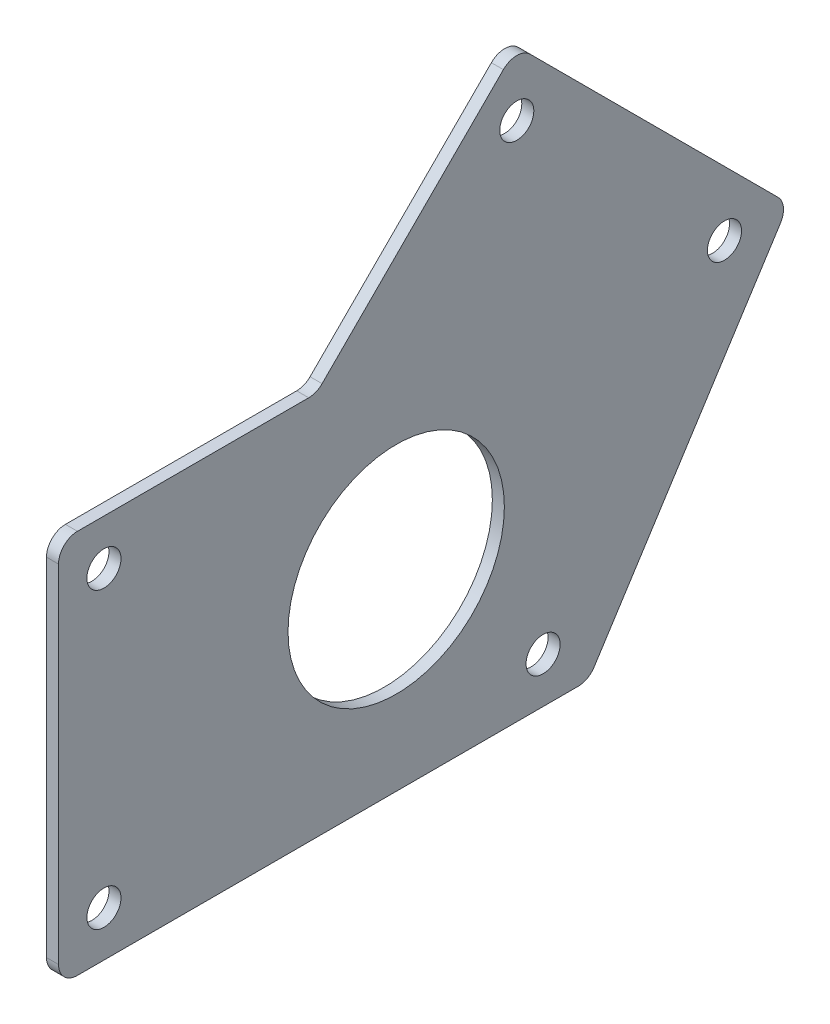
ISO-10303-21;
HEADER;
FILE_DESCRIPTION(('STEP AP214'),'2;1');
FILE_NAME('part.step','',(''),(''),'','','');
FILE_SCHEMA(('AUTOMOTIVE_DESIGN { 1 0 10303 214 1 1 1 1 }'));
ENDSEC;
DATA;
#1=APPLICATION_CONTEXT('core data for automotive mechanical design processes');
#2=APPLICATION_PROTOCOL_DEFINITION('international standard','automotive_design',2000,#1);
#3=PRODUCT_CONTEXT('',#1,'mechanical');
#4=PRODUCT('Part','Part','',(#3));
#5=PRODUCT_RELATED_PRODUCT_CATEGORY('part','',(#4));
#6=PRODUCT_DEFINITION_FORMATION('','',#4);
#7=PRODUCT_DEFINITION_CONTEXT('part definition',#1,'design');
#8=PRODUCT_DEFINITION('design','',#6,#7);
#9=PRODUCT_DEFINITION_SHAPE('','',#8);
#10=(LENGTH_UNIT() NAMED_UNIT(*) SI_UNIT(.MILLI.,.METRE.));
#11=(NAMED_UNIT(*) PLANE_ANGLE_UNIT() SI_UNIT($,.RADIAN.));
#12=(NAMED_UNIT(*) SI_UNIT($,.STERADIAN.) SOLID_ANGLE_UNIT());
#13=UNCERTAINTY_MEASURE_WITH_UNIT(LENGTH_MEASURE(1.E-05),#10,'distance_accuracy_value','');
#14=(GEOMETRIC_REPRESENTATION_CONTEXT(3) GLOBAL_UNCERTAINTY_ASSIGNED_CONTEXT((#13)) GLOBAL_UNIT_ASSIGNED_CONTEXT((#10,
#11,#12)) REPRESENTATION_CONTEXT('',''));
#15=CARTESIAN_POINT('',(0.,0.,0.));
#16=DIRECTION('',(0.,0.,1.));
#17=DIRECTION('',(1.,0.,0.));
#18=AXIS2_PLACEMENT_3D('',#15,#16,#17);
#19=CARTESIAN_POINT('',(103.1875,27.9,-117.643441609791));
#20=DIRECTION('',(-1.,0.,0.));
#21=DIRECTION('',(0.,0.,1.));
#22=AXIS2_PLACEMENT_3D('',#19,#20,#21);
#23=CYLINDRICAL_SURFACE('',#22,2.5);
#24=CARTESIAN_POINT('',(101.6,27.9,-117.643441609791));
#25=DIRECTION('',(1.,0.,0.));
#26=DIRECTION('',(0.,0.,-1.));
#27=AXIS2_PLACEMENT_3D('',#24,#25,#26);
#28=CIRCLE('',#27,2.5);
#29=CARTESIAN_POINT('',(101.6,25.4,-117.643441609791));
#30=VERTEX_POINT('',#29);
#31=CARTESIAN_POINT('',(101.6,26.1322330470337,-119.411208562757));
#32=VERTEX_POINT('',#31);
#33=EDGE_CURVE('E178',#30,#32,#28,.T.);
#34=ORIENTED_EDGE('',*,*,#33,.F.);
#35=DIRECTION('',(-1.,0.,0.));
#36=VECTOR('',#35,1.);
#37=CARTESIAN_POINT('',(103.1875,25.4,-117.643441609791));
#38=LINE('',#37,#36);
#39=CARTESIAN_POINT('',(103.1875,25.4,-117.643441609791));
#40=VERTEX_POINT('',#39);
#41=EDGE_CURVE('E11',#40,#30,#38,.T.);
#42=ORIENTED_EDGE('',*,*,#41,.F.);
#43=CARTESIAN_POINT('',(103.1875,27.9,-117.643441609791));
#44=DIRECTION('',(1.,0.,0.));
#45=DIRECTION('',(0.,0.,-1.));
#46=AXIS2_PLACEMENT_3D('',#43,#44,#45);
#47=CIRCLE('',#46,2.5);
#48=CARTESIAN_POINT('',(103.1875,26.1322330470337,-119.411208562757));
#49=VERTEX_POINT('',#48);
#50=EDGE_CURVE('E227',#40,#49,#47,.T.);
#51=ORIENTED_EDGE('',*,*,#50,.T.);
#52=DIRECTION('',(-1.,0.,0.));
#53=VECTOR('',#52,1.);
#54=CARTESIAN_POINT('',(103.1875,26.1322330470337,-119.411208562757));
#55=LINE('',#54,#53);
#56=EDGE_CURVE('E57',#49,#32,#55,.T.);
#57=ORIENTED_EDGE('',*,*,#56,.T.);
#58=EDGE_LOOP('',(#34,#42,#51,#57));
#59=FACE_BOUND('',#58,.T.);
#60=ADVANCED_FACE('F41',(#59),#23,.F.);
#61=CARTESIAN_POINT('',(103.1875,25.4,0.));
#62=DIRECTION('',(0.,-1.,0.));
#63=DIRECTION('',(0.,0.,-1.));
#64=AXIS2_PLACEMENT_3D('',#61,#62,#63);
#65=PLANE('',#64);
#66=DIRECTION('',(0.,0.,1.));
#67=VECTOR('',#66,1.);
#68=CARTESIAN_POINT('',(101.6,25.4,0.));
#69=LINE('',#68,#67);
#70=CARTESIAN_POINT('',(101.6,25.4,-87.1));
#71=VERTEX_POINT('',#70);
#72=EDGE_CURVE('E180',#30,#71,#69,.T.);
#73=ORIENTED_EDGE('',*,*,#72,.T.);
#74=DIRECTION('',(-1.,0.,0.));
#75=VECTOR('',#74,1.);
#76=CARTESIAN_POINT('',(103.1875,25.4,-87.1));
#77=LINE('',#76,#75);
#78=CARTESIAN_POINT('',(103.1875,25.4,-87.1));
#79=VERTEX_POINT('',#78);
#80=EDGE_CURVE('E49',#79,#71,#77,.T.);
#81=ORIENTED_EDGE('',*,*,#80,.F.);
#82=DIRECTION('',(0.,0.,1.));
#83=VECTOR('',#82,1.);
#84=CARTESIAN_POINT('',(103.1875,25.4,0.));
#85=LINE('',#84,#83);
#86=EDGE_CURVE('E268',#40,#79,#85,.T.);
#87=ORIENTED_EDGE('',*,*,#86,.F.);
#88=ORIENTED_EDGE('',*,*,#41,.T.);
#89=EDGE_LOOP('',(#73,#81,#87,#88));
#90=FACE_BOUND('',#89,.T.);
#91=ADVANCED_FACE('F298',(#90),#65,.F.);
#92=CARTESIAN_POINT('',(103.1875,22.9,-87.1));
#93=DIRECTION('',(-1.,0.,0.));
#94=DIRECTION('',(0.,0.,1.));
#95=AXIS2_PLACEMENT_3D('',#92,#93,#94);
#96=CYLINDRICAL_SURFACE('',#95,2.5);
#97=CARTESIAN_POINT('',(101.6,22.9,-87.1));
#98=DIRECTION('',(1.,0.,0.));
#99=DIRECTION('',(0.,0.,-1.));
#100=AXIS2_PLACEMENT_3D('',#97,#98,#99);
#101=CIRCLE('',#100,2.5);
#102=CARTESIAN_POINT('',(101.6,22.9,-84.6));
#103=VERTEX_POINT('',#102);
#104=EDGE_CURVE('E182',#71,#103,#101,.T.);
#105=ORIENTED_EDGE('',*,*,#104,.T.);
#106=DIRECTION('',(-1.,0.,0.));
#107=VECTOR('',#106,1.);
#108=CARTESIAN_POINT('',(103.1875,22.9,-84.6));
#109=LINE('',#108,#107);
#110=CARTESIAN_POINT('',(103.1875,22.9,-84.6));
#111=VERTEX_POINT('',#110);
#112=EDGE_CURVE('E241',#111,#103,#109,.T.);
#113=ORIENTED_EDGE('',*,*,#112,.F.);
#114=CARTESIAN_POINT('',(103.1875,22.9,-87.1));
#115=DIRECTION('',(1.,0.,0.));
#116=DIRECTION('',(0.,0.,-1.));
#117=AXIS2_PLACEMENT_3D('',#114,#115,#116);
#118=CIRCLE('',#117,2.5);
#119=EDGE_CURVE('E249',#79,#111,#118,.T.);
#120=ORIENTED_EDGE('',*,*,#119,.F.);
#121=ORIENTED_EDGE('',*,*,#80,.T.);
#122=EDGE_LOOP('',(#105,#113,#120,#121));
#123=FACE_BOUND('',#122,.T.);
#124=ADVANCED_FACE('F247',(#123),#96,.T.);
#125=CARTESIAN_POINT('',(103.1875,0.,-84.6));
#126=DIRECTION('',(0.,0.,1.));
#127=DIRECTION('',(1.,0.,0.));
#128=AXIS2_PLACEMENT_3D('',#125,#126,#127);
#129=PLANE('',#128);
#130=DIRECTION('',(0.,1.,0.));
#131=VECTOR('',#130,1.);
#132=CARTESIAN_POINT('',(101.6,0.,-84.6));
#133=LINE('',#132,#131);
#134=CARTESIAN_POINT('',(101.6,-22.9,-84.6));
#135=VERTEX_POINT('',#134);
#136=EDGE_CURVE('E185',#135,#103,#133,.T.);
#137=ORIENTED_EDGE('',*,*,#136,.F.);
#138=DIRECTION('',(-1.,0.,0.));
#139=VECTOR('',#138,1.);
#140=CARTESIAN_POINT('',(103.1875,-22.9,-84.6));
#141=LINE('',#140,#139);
#142=CARTESIAN_POINT('',(103.1875,-22.9,-84.6));
#143=VERTEX_POINT('',#142);
#144=EDGE_CURVE('E239',#143,#135,#141,.T.);
#145=ORIENTED_EDGE('',*,*,#144,.F.);
#146=DIRECTION('',(0.,1.,0.));
#147=VECTOR('',#146,1.);
#148=CARTESIAN_POINT('',(103.1875,0.,-84.6));
#149=LINE('',#148,#147);
#150=EDGE_CURVE('E261',#143,#111,#149,.T.);
#151=ORIENTED_EDGE('',*,*,#150,.T.);
#152=ORIENTED_EDGE('',*,*,#112,.T.);
#153=EDGE_LOOP('',(#137,#145,#151,#152));
#154=FACE_BOUND('',#153,.T.);
#155=ADVANCED_FACE('F258',(#154),#129,.T.);
#156=CARTESIAN_POINT('',(103.1875,-22.9,-87.1));
#157=DIRECTION('',(-1.,0.,0.));
#158=DIRECTION('',(0.,0.,1.));
#159=AXIS2_PLACEMENT_3D('',#156,#157,#158);
#160=CYLINDRICAL_SURFACE('',#159,2.5);
#161=CARTESIAN_POINT('',(101.6,-22.9,-87.1));
#162=DIRECTION('',(1.,0.,0.));
#163=DIRECTION('',(0.,0.,-1.));
#164=AXIS2_PLACEMENT_3D('',#161,#162,#163);
#165=CIRCLE('',#164,2.5);
#166=CARTESIAN_POINT('',(101.6,-25.4,-87.1));
#167=VERTEX_POINT('',#166);
#168=EDGE_CURVE('E188',#167,#135,#165,.F.);
#169=ORIENTED_EDGE('',*,*,#168,.F.);
#170=DIRECTION('',(-1.,0.,0.));
#171=VECTOR('',#170,1.);
#172=CARTESIAN_POINT('',(103.1875,-25.4,-87.1));
#173=LINE('',#172,#171);
#174=CARTESIAN_POINT('',(103.1875,-25.4,-87.1));
#175=VERTEX_POINT('',#174);
#176=EDGE_CURVE('E237',#175,#167,#173,.T.);
#177=ORIENTED_EDGE('',*,*,#176,.F.);
#178=CARTESIAN_POINT('',(103.1875,-22.9,-87.1));
#179=DIRECTION('',(1.,0.,0.));
#180=DIRECTION('',(0.,0.,-1.));
#181=AXIS2_PLACEMENT_3D('',#178,#179,#180);
#182=CIRCLE('',#181,2.5);
#183=EDGE_CURVE('E264',#175,#143,#182,.F.);
#184=ORIENTED_EDGE('',*,*,#183,.T.);
#185=ORIENTED_EDGE('',*,*,#144,.T.);
#186=EDGE_LOOP('',(#169,#177,#184,#185));
#187=FACE_BOUND('',#186,.T.);
#188=ADVANCED_FACE('F309',(#187),#160,.T.);
#189=CARTESIAN_POINT('',(103.1875,-25.4,0.));
#190=DIRECTION('',(0.,-1.,0.));
#191=DIRECTION('',(0.,0.,-1.));
#192=AXIS2_PLACEMENT_3D('',#189,#190,#191);
#193=PLANE('',#192);
#194=DIRECTION('',(0.,0.,1.));
#195=VECTOR('',#194,1.);
#196=CARTESIAN_POINT('',(101.6,-25.4,0.));
#197=LINE('',#196,#195);
#198=CARTESIAN_POINT('',(101.6,-25.4,-153.231778176145));
#199=VERTEX_POINT('',#198);
#200=EDGE_CURVE('E191',#199,#167,#197,.T.);
#201=ORIENTED_EDGE('',*,*,#200,.F.);
#202=DIRECTION('',(-1.,0.,0.));
#203=VECTOR('',#202,1.);
#204=CARTESIAN_POINT('',(103.1875,-25.4,-153.231778176145));
#205=LINE('',#204,#203);
#206=CARTESIAN_POINT('',(103.1875,-25.4,-153.231778176145));
#207=VERTEX_POINT('',#206);
#208=EDGE_CURVE('E235',#207,#199,#205,.T.);
#209=ORIENTED_EDGE('',*,*,#208,.F.);
#210=DIRECTION('',(0.,0.,1.));
#211=VECTOR('',#210,1.);
#212=CARTESIAN_POINT('',(103.1875,-25.4,0.));
#213=LINE('',#212,#211);
#214=EDGE_CURVE('E266',#207,#175,#213,.T.);
#215=ORIENTED_EDGE('',*,*,#214,.T.);
#216=ORIENTED_EDGE('',*,*,#176,.T.);
#217=EDGE_LOOP('',(#201,#209,#215,#216));
#218=FACE_BOUND('',#217,.T.);
#219=ADVANCED_FACE('F312',(#218),#193,.T.);
#220=CARTESIAN_POINT('',(103.1875,-22.9,-153.231778176145));
#221=DIRECTION('',(-1.,0.,0.));
#222=DIRECTION('',(0.,0.,1.));
#223=AXIS2_PLACEMENT_3D('',#220,#221,#222);
#224=CYLINDRICAL_SURFACE('',#223,2.5);
#225=CARTESIAN_POINT('',(101.6,-22.9,-153.231778176145));
#226=DIRECTION('',(1.,0.,0.));
#227=DIRECTION('',(0.,0.,-1.));
#228=AXIS2_PLACEMENT_3D('',#225,#226,#227);
#229=CIRCLE('',#228,2.5);
#230=CARTESIAN_POINT('',(101.6,-24.2475598229923,-155.337504303507));
#231=VERTEX_POINT('',#230);
#232=EDGE_CURVE('E194',#199,#231,#229,.T.);
#233=ORIENTED_EDGE('',*,*,#232,.T.);
#234=DIRECTION('',(-1.,0.,0.));
#235=VECTOR('',#234,1.);
#236=CARTESIAN_POINT('',(103.1875,-24.2475598229923,-155.337504303507));
#237=LINE('',#236,#235);
#238=CARTESIAN_POINT('',(103.1875,-24.2475598229923,-155.337504303507));
#239=VERTEX_POINT('',#238);
#240=EDGE_CURVE('E233',#239,#231,#237,.T.);
#241=ORIENTED_EDGE('',*,*,#240,.F.);
#242=CARTESIAN_POINT('',(103.1875,-22.9,-153.231778176145));
#243=DIRECTION('',(1.,0.,0.));
#244=DIRECTION('',(0.,0.,-1.));
#245=AXIS2_PLACEMENT_3D('',#242,#243,#244);
#246=CIRCLE('',#245,2.5);
#247=EDGE_CURVE('E274',#207,#239,#246,.T.);
#248=ORIENTED_EDGE('',*,*,#247,.F.);
#249=ORIENTED_EDGE('',*,*,#208,.T.);
#250=EDGE_LOOP('',(#233,#241,#248,#249));
#251=FACE_BOUND('',#250,.T.);
#252=ADVANCED_FACE('F316',(#251),#224,.T.);
#253=CARTESIAN_POINT('',(103.1875,-77.5705625422909,-121.213438893427));
#254=DIRECTION('',(0.,-0.539023929196903,-0.842290450945));
#255=DIRECTION('',(0.,0.842290450945,-0.539023929196903));
#256=AXIS2_PLACEMENT_3D('',#253,#254,#255);
#257=PLANE('',#256);
#258=DIRECTION('',(0.,-0.842290450945,0.539023929196903));
#259=VECTOR('',#258,1.);
#260=CARTESIAN_POINT('',(101.6,-77.5705625422909,-121.213438893427));
#261=LINE('',#260,#259);
#262=CARTESIAN_POINT('',(101.6,14.2312008588714,-179.961994288043));
#263=VERTEX_POINT('',#262);
#264=EDGE_CURVE('E197',#263,#231,#261,.T.);
#265=ORIENTED_EDGE('',*,*,#264,.F.);
#266=DIRECTION('',(-1.,0.,0.));
#267=VECTOR('',#266,1.);
#268=CARTESIAN_POINT('',(103.1875,14.2312008588714,-179.961994288043));
#269=LINE('',#268,#267);
#270=CARTESIAN_POINT('',(103.1875,14.2312008588714,-179.961994288043));
#271=VERTEX_POINT('',#270);
#272=EDGE_CURVE('E231',#271,#263,#269,.T.);
#273=ORIENTED_EDGE('',*,*,#272,.F.);
#274=DIRECTION('',(0.,-0.842290450945,0.539023929196903));
#275=VECTOR('',#274,1.);
#276=CARTESIAN_POINT('',(103.1875,-77.5705625422909,-121.213438893427));
#277=LINE('',#276,#275);
#278=EDGE_CURVE('E276',#271,#239,#277,.T.);
#279=ORIENTED_EDGE('',*,*,#278,.T.);
#280=ORIENTED_EDGE('',*,*,#240,.T.);
#281=EDGE_LOOP('',(#265,#273,#279,#280));
#282=FACE_BOUND('',#281,.T.);
#283=ADVANCED_FACE('F320',(#282),#257,.T.);
#284=CARTESIAN_POINT('',(103.1875,15.5787606818636,-177.856268160681));
#285=DIRECTION('',(-1.,0.,0.));
#286=DIRECTION('',(0.,0.,1.));
#287=AXIS2_PLACEMENT_3D('',#284,#285,#286);
#288=CYLINDRICAL_SURFACE('',#287,2.49999999999999);
#289=CARTESIAN_POINT('',(101.6,15.5787606818636,-177.856268160681));
#290=DIRECTION('',(1.,0.,0.));
#291=DIRECTION('',(0.,0.,-1.));
#292=AXIS2_PLACEMENT_3D('',#289,#290,#291);
#293=CIRCLE('',#292,2.49999999999999);
#294=CARTESIAN_POINT('',(101.6,17.34652763483,-179.624035113647));
#295=VERTEX_POINT('',#294);
#296=EDGE_CURVE('E200',#295,#263,#293,.F.);
#297=ORIENTED_EDGE('',*,*,#296,.F.);
#298=DIRECTION('',(-1.,0.,0.));
#299=VECTOR('',#298,1.);
#300=CARTESIAN_POINT('',(103.1875,17.34652763483,-179.624035113647));
#301=LINE('',#300,#299);
#302=CARTESIAN_POINT('',(103.1875,17.34652763483,-179.624035113647));
#303=VERTEX_POINT('',#302);
#304=EDGE_CURVE('E140',#303,#295,#301,.T.);
#305=ORIENTED_EDGE('',*,*,#304,.F.);
#306=CARTESIAN_POINT('',(103.1875,15.5787606818636,-177.856268160681));
#307=DIRECTION('',(1.,0.,0.));
#308=DIRECTION('',(0.,0.,-1.));
#309=AXIS2_PLACEMENT_3D('',#306,#307,#308);
#310=CIRCLE('',#309,2.49999999999999);
#311=EDGE_CURVE('E152',#303,#271,#310,.F.);
#312=ORIENTED_EDGE('',*,*,#311,.T.);
#313=ORIENTED_EDGE('',*,*,#272,.T.);
#314=EDGE_LOOP('',(#297,#305,#312,#313));
#315=FACE_BOUND('',#314,.T.);
#316=ADVANCED_FACE('F280',(#315),#288,.T.);
#317=CARTESIAN_POINT('',(103.1875,98.4852813742386,-98.4852813742386));
#318=DIRECTION('',(0.,0.707106781186548,-0.707106781186547));
#319=DIRECTION('',(0.,0.707106781186547,0.707106781186548));
#320=AXIS2_PLACEMENT_3D('',#317,#318,#319);
#321=PLANE('',#320);
#322=DIRECTION('',(0.,-0.707106781186547,-0.707106781186548));
#323=VECTOR('',#322,1.);
#324=CARTESIAN_POINT('',(101.6,98.4852813742386,-98.4852813742386));
#325=LINE('',#324,#323);
#326=CARTESIAN_POINT('',(101.6,50.0780266634105,-146.892536085067));
#327=VERTEX_POINT('',#326);
#328=EDGE_CURVE('E136',#327,#295,#325,.T.);
#329=ORIENTED_EDGE('',*,*,#328,.F.);
#330=DIRECTION('',(-1.,0.,0.));
#331=VECTOR('',#330,1.);
#332=CARTESIAN_POINT('',(103.1875,50.0780266634105,-146.892536085067));
#333=LINE('',#332,#331);
#334=CARTESIAN_POINT('',(103.1875,50.0780266634105,-146.892536085067));
#335=VERTEX_POINT('',#334);
#336=EDGE_CURVE('E131',#335,#327,#333,.T.);
#337=ORIENTED_EDGE('',*,*,#336,.F.);
#338=DIRECTION('',(0.,-0.707106781186547,-0.707106781186548));
#339=VECTOR('',#338,1.);
#340=CARTESIAN_POINT('',(103.1875,98.4852813742386,-98.4852813742386));
#341=LINE('',#340,#339);
#342=EDGE_CURVE('E134',#335,#303,#341,.T.);
#343=ORIENTED_EDGE('',*,*,#342,.T.);
#344=ORIENTED_EDGE('',*,*,#304,.T.);
#345=EDGE_LOOP('',(#329,#337,#343,#344));
#346=FACE_BOUND('',#345,.T.);
#347=ADVANCED_FACE('F133',(#346),#321,.T.);
#348=CARTESIAN_POINT('',(103.1875,48.3102597104441,-145.1247691321));
#349=DIRECTION('',(-1.,0.,0.));
#350=DIRECTION('',(0.,0.,1.));
#351=AXIS2_PLACEMENT_3D('',#348,#349,#350);
#352=CYLINDRICAL_SURFACE('',#351,2.5);
#353=CARTESIAN_POINT('',(101.6,48.3102597104441,-145.1247691321));
#354=DIRECTION('',(1.,0.,0.));
#355=DIRECTION('',(0.,0.,-1.));
#356=AXIS2_PLACEMENT_3D('',#353,#354,#355);
#357=CIRCLE('',#356,2.5);
#358=CARTESIAN_POINT('',(101.6,50.0780266634105,-143.357002179134));
#359=VERTEX_POINT('',#358);
#360=EDGE_CURVE('E204',#359,#327,#357,.F.);
#361=ORIENTED_EDGE('',*,*,#360,.F.);
#362=DIRECTION('',(-1.,0.,0.));
#363=VECTOR('',#362,1.);
#364=CARTESIAN_POINT('',(103.1875,50.0780266634105,-143.357002179134));
#365=LINE('',#364,#363);
#366=CARTESIAN_POINT('',(103.1875,50.0780266634105,-143.357002179134));
#367=VERTEX_POINT('',#366);
#368=EDGE_CURVE('E94',#367,#359,#365,.T.);
#369=ORIENTED_EDGE('',*,*,#368,.F.);
#370=CARTESIAN_POINT('',(103.1875,48.3102597104441,-145.1247691321));
#371=DIRECTION('',(1.,0.,0.));
#372=DIRECTION('',(0.,0.,-1.));
#373=AXIS2_PLACEMENT_3D('',#370,#371,#372);
#374=CIRCLE('',#373,2.5);
#375=EDGE_CURVE('E149',#367,#335,#374,.F.);
#376=ORIENTED_EDGE('',*,*,#375,.T.);
#377=ORIENTED_EDGE('',*,*,#336,.T.);
#378=EDGE_LOOP('',(#361,#369,#376,#377));
#379=FACE_BOUND('',#378,.T.);
#380=ADVANCED_FACE('F154',(#379),#352,.T.);
#381=CARTESIAN_POINT('',(103.1875,-19.4,-90.6));
#382=DIRECTION('',(-1.,0.,0.));
#383=DIRECTION('',(0.,0.,1.));
#384=AXIS2_PLACEMENT_3D('',#381,#382,#383);
#385=CYLINDRICAL_SURFACE('',#384,2.25);
#386=CARTESIAN_POINT('',(103.1875,-19.4,-90.6));
#387=DIRECTION('',(1.,0.,0.));
#388=DIRECTION('',(0.,0.,-1.));
#389=AXIS2_PLACEMENT_3D('',#386,#387,#388);
#390=CIRCLE('',#389,2.25);
#391=CARTESIAN_POINT('',(103.1875,-19.4,-92.85));
#392=VERTEX_POINT('',#391);
#393=EDGE_CURVE('E172',#392,#392,#390,.T.);
#394=ORIENTED_EDGE('',*,*,#393,.T.);
#395=EDGE_LOOP('',(#394));
#396=FACE_BOUND('',#395,.T.);
#397=CARTESIAN_POINT('',(101.6,-19.4,-90.6));
#398=DIRECTION('',(1.,0.,0.));
#399=DIRECTION('',(0.,0.,-1.));
#400=AXIS2_PLACEMENT_3D('',#397,#398,#399);
#401=CIRCLE('',#400,2.25);
#402=CARTESIAN_POINT('',(101.6,-19.4,-92.85));
#403=VERTEX_POINT('',#402);
#404=EDGE_CURVE('E221',#403,#403,#401,.T.);
#405=ORIENTED_EDGE('',*,*,#404,.F.);
#406=EDGE_LOOP('',(#405));
#407=FACE_BOUND('',#406,.T.);
#408=ADVANCED_FACE('F329',(#396,#407),#385,.F.);
#409=CARTESIAN_POINT('',(103.1875,-19.4,-148.6));
#410=DIRECTION('',(-1.,0.,0.));
#411=DIRECTION('',(0.,0.,1.));
#412=AXIS2_PLACEMENT_3D('',#409,#410,#411);
#413=CYLINDRICAL_SURFACE('',#412,2.25000000000001);
#414=CARTESIAN_POINT('',(103.1875,-19.4,-148.6));
#415=DIRECTION('',(1.,0.,0.));
#416=DIRECTION('',(0.,0.,-1.));
#417=AXIS2_PLACEMENT_3D('',#414,#415,#416);
#418=CIRCLE('',#417,2.25000000000001);
#419=CARTESIAN_POINT('',(103.1875,-19.4,-150.85));
#420=VERTEX_POINT('',#419);
#421=EDGE_CURVE('E169',#420,#420,#418,.T.);
#422=ORIENTED_EDGE('',*,*,#421,.T.);
#423=EDGE_LOOP('',(#422));
#424=FACE_BOUND('',#423,.T.);
#425=CARTESIAN_POINT('',(101.6,-19.4,-148.6));
#426=DIRECTION('',(1.,0.,0.));
#427=DIRECTION('',(0.,0.,-1.));
#428=AXIS2_PLACEMENT_3D('',#425,#426,#427);
#429=CIRCLE('',#428,2.25000000000001);
#430=CARTESIAN_POINT('',(101.6,-19.4,-150.85));
#431=VERTEX_POINT('',#430);
#432=EDGE_CURVE('E218',#431,#431,#429,.T.);
#433=ORIENTED_EDGE('',*,*,#432,.F.);
#434=EDGE_LOOP('',(#433));
#435=FACE_BOUND('',#434,.T.);
#436=ADVANCED_FACE('F333',(#424,#435),#413,.F.);
#437=CARTESIAN_POINT('',(103.1875,15.924769132098,-172.560512242141));
#438=DIRECTION('',(-1.,0.,0.));
#439=DIRECTION('',(0.,0.,1.));
#440=AXIS2_PLACEMENT_3D('',#437,#438,#439);
#441=CYLINDRICAL_SURFACE('',#440,2.25000000000001);
#442=CARTESIAN_POINT('',(103.1875,15.924769132098,-172.560512242141));
#443=DIRECTION('',(1.,0.,0.));
#444=DIRECTION('',(0.,0.,-1.));
#445=AXIS2_PLACEMENT_3D('',#442,#443,#444);
#446=CIRCLE('',#445,2.25000000000001);
#447=CARTESIAN_POINT('',(103.1875,15.924769132098,-174.810512242141));
#448=VERTEX_POINT('',#447);
#449=EDGE_CURVE('E166',#448,#448,#446,.T.);
#450=ORIENTED_EDGE('',*,*,#449,.T.);
#451=EDGE_LOOP('',(#450));
#452=FACE_BOUND('',#451,.T.);
#453=CARTESIAN_POINT('',(101.6,15.924769132098,-172.560512242141));
#454=DIRECTION('',(1.,0.,0.));
#455=DIRECTION('',(0.,0.,-1.));
#456=AXIS2_PLACEMENT_3D('',#453,#454,#455);
#457=CIRCLE('',#456,2.25000000000001);
#458=CARTESIAN_POINT('',(101.6,15.924769132098,-174.810512242141));
#459=VERTEX_POINT('',#458);
#460=EDGE_CURVE('E215',#459,#459,#457,.T.);
#461=ORIENTED_EDGE('',*,*,#460,.F.);
#462=EDGE_LOOP('',(#461));
#463=FACE_BOUND('',#462,.T.);
#464=ADVANCED_FACE('F339',(#452,#463),#441,.F.);
#465=CARTESIAN_POINT('',(103.1875,43.3605122421383,-145.1247691321));
#466=DIRECTION('',(-1.,0.,0.));
#467=DIRECTION('',(0.,0.,1.));
#468=AXIS2_PLACEMENT_3D('',#465,#466,#467);
#469=CYLINDRICAL_SURFACE('',#468,2.25000000000001);
#470=CARTESIAN_POINT('',(103.1875,43.3605122421383,-145.1247691321));
#471=DIRECTION('',(1.,0.,0.));
#472=DIRECTION('',(0.,0.,-1.));
#473=AXIS2_PLACEMENT_3D('',#470,#471,#472);
#474=CIRCLE('',#473,2.25000000000001);
#475=CARTESIAN_POINT('',(103.1875,43.3605122421383,-147.3747691321));
#476=VERTEX_POINT('',#475);
#477=EDGE_CURVE('E163',#476,#476,#474,.T.);
#478=ORIENTED_EDGE('',*,*,#477,.T.);
#479=EDGE_LOOP('',(#478));
#480=FACE_BOUND('',#479,.T.);
#481=CARTESIAN_POINT('',(101.6,43.3605122421383,-145.1247691321));
#482=DIRECTION('',(1.,0.,0.));
#483=DIRECTION('',(0.,0.,-1.));
#484=AXIS2_PLACEMENT_3D('',#481,#482,#483);
#485=CIRCLE('',#484,2.25000000000001);
#486=CARTESIAN_POINT('',(101.6,43.3605122421383,-147.3747691321));
#487=VERTEX_POINT('',#486);
#488=EDGE_CURVE('E212',#487,#487,#485,.T.);
#489=ORIENTED_EDGE('',*,*,#488,.F.);
#490=EDGE_LOOP('',(#489));
#491=FACE_BOUND('',#490,.T.);
#492=ADVANCED_FACE('F293',(#480,#491),#469,.F.);
#493=CARTESIAN_POINT('',(103.1875,0.,-129.2));
#494=DIRECTION('',(-1.,0.,0.));
#495=DIRECTION('',(0.,0.,1.));
#496=AXIS2_PLACEMENT_3D('',#493,#494,#495);
#497=CYLINDRICAL_SURFACE('',#496,14.2875);
#498=CARTESIAN_POINT('',(103.1875,0.,-129.2));
#499=DIRECTION('',(1.,0.,0.));
#500=DIRECTION('',(0.,0.,-1.));
#501=AXIS2_PLACEMENT_3D('',#498,#499,#500);
#502=CIRCLE('',#501,14.2875);
#503=CARTESIAN_POINT('',(103.1875,0.,-143.4875));
#504=VERTEX_POINT('',#503);
#505=EDGE_CURVE('E157',#504,#504,#502,.T.);
#506=ORIENTED_EDGE('',*,*,#505,.T.);
#507=EDGE_LOOP('',(#506));
#508=FACE_BOUND('',#507,.T.);
#509=CARTESIAN_POINT('',(101.6,0.,-129.2));
#510=DIRECTION('',(1.,0.,0.));
#511=DIRECTION('',(0.,0.,-1.));
#512=AXIS2_PLACEMENT_3D('',#509,#510,#511);
#513=CIRCLE('',#512,14.2875);
#514=CARTESIAN_POINT('',(101.6,0.,-143.4875));
#515=VERTEX_POINT('',#514);
#516=EDGE_CURVE('E209',#515,#515,#513,.T.);
#517=ORIENTED_EDGE('',*,*,#516,.F.);
#518=EDGE_LOOP('',(#517));
#519=FACE_BOUND('',#518,.T.);
#520=ADVANCED_FACE('F285',(#508,#519),#497,.F.);
#521=CARTESIAN_POINT('',(103.1875,-46.6394877578617,-46.6394877578617));
#522=DIRECTION('',(0.,0.707106781186548,0.707106781186547));
#523=DIRECTION('',(0.,-0.707106781186547,0.707106781186548));
#524=AXIS2_PLACEMENT_3D('',#521,#522,#523);
#525=PLANE('',#524);
#526=DIRECTION('',(0.,0.707106781186547,-0.707106781186548));
#527=VECTOR('',#526,1.);
#528=CARTESIAN_POINT('',(101.6,-46.6394877578617,-46.6394877578617));
#529=LINE('',#528,#527);
#530=EDGE_CURVE('E206',#32,#359,#529,.T.);
#531=ORIENTED_EDGE('',*,*,#530,.F.);
#532=ORIENTED_EDGE('',*,*,#56,.F.);
#533=DIRECTION('',(0.,0.707106781186547,-0.707106781186548));
#534=VECTOR('',#533,1.);
#535=CARTESIAN_POINT('',(103.1875,-46.6394877578617,-46.6394877578617));
#536=LINE('',#535,#534);
#537=EDGE_CURVE('E155',#49,#367,#536,.T.);
#538=ORIENTED_EDGE('',*,*,#537,.T.);
#539=ORIENTED_EDGE('',*,*,#368,.T.);
#540=EDGE_LOOP('',(#531,#532,#538,#539));
#541=FACE_BOUND('',#540,.T.);
#542=ADVANCED_FACE('F282',(#541),#525,.T.);
#543=CARTESIAN_POINT('',(103.1875,19.4,-90.6));
#544=DIRECTION('',(-1.,0.,0.));
#545=DIRECTION('',(0.,0.,1.));
#546=AXIS2_PLACEMENT_3D('',#543,#544,#545);
#547=CYLINDRICAL_SURFACE('',#546,2.25);
#548=CARTESIAN_POINT('',(103.1875,19.4,-90.6));
#549=DIRECTION('',(1.,0.,0.));
#550=DIRECTION('',(0.,0.,-1.));
#551=AXIS2_PLACEMENT_3D('',#548,#549,#550);
#552=CIRCLE('',#551,2.25);
#553=CARTESIAN_POINT('',(103.1875,19.4,-92.85));
#554=VERTEX_POINT('',#553);
#555=EDGE_CURVE('E175',#554,#554,#552,.T.);
#556=ORIENTED_EDGE('',*,*,#555,.T.);
#557=EDGE_LOOP('',(#556));
#558=FACE_BOUND('',#557,.T.);
#559=CARTESIAN_POINT('',(101.6,19.4,-90.6));
#560=DIRECTION('',(1.,0.,0.));
#561=DIRECTION('',(0.,0.,-1.));
#562=AXIS2_PLACEMENT_3D('',#559,#560,#561);
#563=CIRCLE('',#562,2.25);
#564=CARTESIAN_POINT('',(101.6,19.4,-92.85));
#565=VERTEX_POINT('',#564);
#566=EDGE_CURVE('E224',#565,#565,#563,.T.);
#567=ORIENTED_EDGE('',*,*,#566,.F.);
#568=EDGE_LOOP('',(#567));
#569=FACE_BOUND('',#568,.T.);
#570=ADVANCED_FACE('F284',(#558,#569),#547,.F.);
#571=CARTESIAN_POINT('',(103.1875,0.,0.));
#572=DIRECTION('',(1.,0.,0.));
#573=DIRECTION('',(0.,0.,-1.));
#574=AXIS2_PLACEMENT_3D('',#571,#572,#573);
#575=PLANE('',#574);
#576=ORIENTED_EDGE('',*,*,#50,.F.);
#577=ORIENTED_EDGE('',*,*,#86,.T.);
#578=ORIENTED_EDGE('',*,*,#119,.T.);
#579=ORIENTED_EDGE('',*,*,#150,.F.);
#580=ORIENTED_EDGE('',*,*,#183,.F.);
#581=ORIENTED_EDGE('',*,*,#214,.F.);
#582=ORIENTED_EDGE('',*,*,#247,.T.);
#583=ORIENTED_EDGE('',*,*,#278,.F.);
#584=ORIENTED_EDGE('',*,*,#311,.F.);
#585=ORIENTED_EDGE('',*,*,#342,.F.);
#586=ORIENTED_EDGE('',*,*,#375,.F.);
#587=ORIENTED_EDGE('',*,*,#537,.F.);
#588=EDGE_LOOP('',(#576,#577,#578,#579,#580,#581,#582,#583,#584,#585,#586,#587));
#589=FACE_BOUND('',#588,.T.);
#590=ORIENTED_EDGE('',*,*,#505,.F.);
#591=EDGE_LOOP('',(#590));
#592=FACE_BOUND('',#591,.T.);
#593=ORIENTED_EDGE('',*,*,#477,.F.);
#594=EDGE_LOOP('',(#593));
#595=FACE_BOUND('',#594,.T.);
#596=ORIENTED_EDGE('',*,*,#449,.F.);
#597=EDGE_LOOP('',(#596));
#598=FACE_BOUND('',#597,.T.);
#599=ORIENTED_EDGE('',*,*,#421,.F.);
#600=EDGE_LOOP('',(#599));
#601=FACE_BOUND('',#600,.T.);
#602=ORIENTED_EDGE('',*,*,#393,.F.);
#603=EDGE_LOOP('',(#602));
#604=FACE_BOUND('',#603,.T.);
#605=ORIENTED_EDGE('',*,*,#555,.F.);
#606=EDGE_LOOP('',(#605));
#607=FACE_BOUND('',#606,.T.);
#608=ADVANCED_FACE('F146',(#589,#592,#595,#598,#601,#604,#607),#575,.T.);
#609=CARTESIAN_POINT('',(101.6,0.,0.));
#610=DIRECTION('',(1.,0.,0.));
#611=DIRECTION('',(0.,0.,-1.));
#612=AXIS2_PLACEMENT_3D('',#609,#610,#611);
#613=PLANE('',#612);
#614=ORIENTED_EDGE('',*,*,#33,.T.);
#615=ORIENTED_EDGE('',*,*,#530,.T.);
#616=ORIENTED_EDGE('',*,*,#360,.T.);
#617=ORIENTED_EDGE('',*,*,#328,.T.);
#618=ORIENTED_EDGE('',*,*,#296,.T.);
#619=ORIENTED_EDGE('',*,*,#264,.T.);
#620=ORIENTED_EDGE('',*,*,#232,.F.);
#621=ORIENTED_EDGE('',*,*,#200,.T.);
#622=ORIENTED_EDGE('',*,*,#168,.T.);
#623=ORIENTED_EDGE('',*,*,#136,.T.);
#624=ORIENTED_EDGE('',*,*,#104,.F.);
#625=ORIENTED_EDGE('',*,*,#72,.F.);
#626=EDGE_LOOP('',(#614,#615,#616,#617,#618,#619,#620,#621,#622,#623,#624,#625));
#627=FACE_BOUND('',#626,.T.);
#628=ORIENTED_EDGE('',*,*,#516,.T.);
#629=EDGE_LOOP('',(#628));
#630=FACE_BOUND('',#629,.T.);
#631=ORIENTED_EDGE('',*,*,#488,.T.);
#632=EDGE_LOOP('',(#631));
#633=FACE_BOUND('',#632,.T.);
#634=ORIENTED_EDGE('',*,*,#460,.T.);
#635=EDGE_LOOP('',(#634));
#636=FACE_BOUND('',#635,.T.);
#637=ORIENTED_EDGE('',*,*,#432,.T.);
#638=EDGE_LOOP('',(#637));
#639=FACE_BOUND('',#638,.T.);
#640=ORIENTED_EDGE('',*,*,#404,.T.);
#641=EDGE_LOOP('',(#640));
#642=FACE_BOUND('',#641,.T.);
#643=ORIENTED_EDGE('',*,*,#566,.T.);
#644=EDGE_LOOP('',(#643));
#645=FACE_BOUND('',#644,.T.);
#646=ADVANCED_FACE('F253',(#627,#630,#633,#636,#639,#642,#645),#613,.F.);
#647=CLOSED_SHELL('',(#60,#91,#124,#155,#188,#219,#252,#283,#316,#347,#380,#408,#436,#464,#492,
#520,#542,#570,#608,#646));
#648=MANIFOLD_SOLID_BREP('B2',#647);
#649=ADVANCED_BREP_SHAPE_REPRESENTATION('',(#18,#648),#14);
#650=SHAPE_DEFINITION_REPRESENTATION(#9,#649);
ENDSEC;
END-ISO-10303-21;
